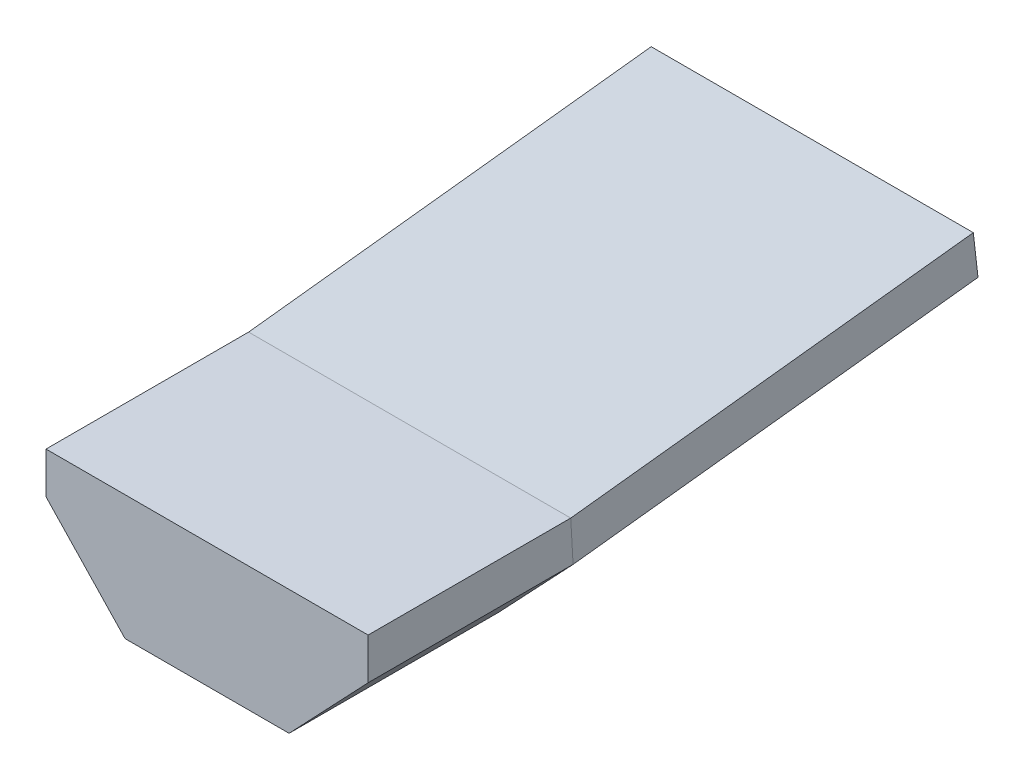
ISO-10303-21;
HEADER;
FILE_DESCRIPTION(('STEP AP214'),'2;1');
FILE_NAME('part.step','',(''),(''),'','','');
FILE_SCHEMA(('AUTOMOTIVE_DESIGN { 1 0 10303 214 1 1 1 1 }'));
ENDSEC;
DATA;
#1=APPLICATION_CONTEXT('core data for automotive mechanical design processes');
#2=APPLICATION_PROTOCOL_DEFINITION('international standard','automotive_design',2000,#1);
#3=PRODUCT_CONTEXT('',#1,'mechanical');
#4=PRODUCT('Part','Part','',(#3));
#5=PRODUCT_RELATED_PRODUCT_CATEGORY('part','',(#4));
#6=PRODUCT_DEFINITION_FORMATION('','',#4);
#7=PRODUCT_DEFINITION_CONTEXT('part definition',#1,'design');
#8=PRODUCT_DEFINITION('design','',#6,#7);
#9=PRODUCT_DEFINITION_SHAPE('','',#8);
#10=(LENGTH_UNIT() NAMED_UNIT(*) SI_UNIT(.MILLI.,.METRE.));
#11=(NAMED_UNIT(*) PLANE_ANGLE_UNIT() SI_UNIT($,.RADIAN.));
#12=(NAMED_UNIT(*) SI_UNIT($,.STERADIAN.) SOLID_ANGLE_UNIT());
#13=UNCERTAINTY_MEASURE_WITH_UNIT(LENGTH_MEASURE(1.E-05),#10,'distance_accuracy_value','');
#14=(GEOMETRIC_REPRESENTATION_CONTEXT(3) GLOBAL_UNCERTAINTY_ASSIGNED_CONTEXT((#13)) GLOBAL_UNIT_ASSIGNED_CONTEXT((#10,
#11,#12)) REPRESENTATION_CONTEXT('',''));
#15=CARTESIAN_POINT('',(0.,0.,0.));
#16=DIRECTION('',(0.,0.,1.));
#17=DIRECTION('',(1.,0.,0.));
#18=AXIS2_PLACEMENT_3D('',#15,#16,#17);
#19=CARTESIAN_POINT('',(0.,2.26406427535814,-29.8714371135318));
#20=DIRECTION('',(0.,0.113203213767907,-0.993571855676587));
#21=DIRECTION('',(-1.,0.,0.));
#22=AXIS2_PLACEMENT_3D('',#19,#20,#21);
#23=PLANE('',#22);
#24=DIRECTION('',(0.688304815664138,0.720758473608971,0.0821200551292038));
#25=VECTOR('',#24,1.);
#26=CARTESIAN_POINT('',(7.95,0.237177689777905,-30.1023716696183));
#27=LINE('',#26,#25);
#28=CARTESIAN_POINT('',(4.048,-3.84880209711135,-30.5679102621457));
#29=VERTEX_POINT('',#28);
#30=CARTESIAN_POINT('',(7.95,0.237177689777905,-30.1023716696183));
#31=VERTEX_POINT('',#30);
#32=EDGE_CURVE('E190',#29,#31,#27,.T.);
#33=ORIENTED_EDGE('',*,*,#32,.F.);
#34=DIRECTION('',(1.,0.,0.));
#35=VECTOR('',#34,1.);
#36=CARTESIAN_POINT('',(4.048,-3.84880209711135,-30.5679102621457));
#37=LINE('',#36,#35);
#38=CARTESIAN_POINT('',(-4.048,-3.84880209711135,-30.5679102621457));
#39=VERTEX_POINT('',#38);
#40=EDGE_CURVE('E147',#39,#29,#37,.T.);
#41=ORIENTED_EDGE('',*,*,#40,.F.);
#42=DIRECTION('',(0.688304815664138,-0.720758473608971,-0.0821200551292038));
#43=VECTOR('',#42,1.);
#44=CARTESIAN_POINT('',(-4.048,-3.84880209711135,-30.5679102621457));
#45=LINE('',#44,#43);
#46=CARTESIAN_POINT('',(-7.95,0.237177689777902,-30.1023716696183));
#47=VERTEX_POINT('',#46);
#48=EDGE_CURVE('E195',#47,#39,#45,.T.);
#49=ORIENTED_EDGE('',*,*,#48,.F.);
#50=DIRECTION('',(0.,-0.993571855676587,-0.113203213767907));
#51=VECTOR('',#50,1.);
#52=CARTESIAN_POINT('',(-7.95,0.237177689777902,-30.1023716696183));
#53=LINE('',#52,#51);
#54=CARTESIAN_POINT('',(-7.95,2.26406427535814,-29.8714371135318));
#55=VERTEX_POINT('',#54);
#56=EDGE_CURVE('E198',#55,#47,#53,.T.);
#57=ORIENTED_EDGE('',*,*,#56,.F.);
#58=DIRECTION('',(-1.,0.,0.));
#59=VECTOR('',#58,1.);
#60=CARTESIAN_POINT('',(-7.95,2.26406427535814,-29.8714371135318));
#61=LINE('',#60,#59);
#62=CARTESIAN_POINT('',(7.95,2.26406427535814,-29.8714371135318));
#63=VERTEX_POINT('',#62);
#64=EDGE_CURVE('E84',#63,#55,#61,.T.);
#65=ORIENTED_EDGE('',*,*,#64,.F.);
#66=DIRECTION('',(0.,0.993571855676587,0.113203213767907));
#67=VECTOR('',#66,1.);
#68=CARTESIAN_POINT('',(7.95,2.26406427535814,-29.8714371135318));
#69=LINE('',#68,#67);
#70=EDGE_CURVE('E92',#31,#63,#69,.T.);
#71=ORIENTED_EDGE('',*,*,#70,.F.);
#72=EDGE_LOOP('',(#33,#41,#49,#57,#65,#71));
#73=FACE_BOUND('',#72,.T.);
#74=ADVANCED_FACE('F43',(#73),#23,.T.);
#75=CARTESIAN_POINT('',(0.,0.,0.));
#76=DIRECTION('',(0.,0.,-1.));
#77=DIRECTION('',(-1.,0.,0.));
#78=AXIS2_PLACEMENT_3D('',#75,#76,#77);
#79=PLANE('',#78);
#80=DIRECTION('',(0.688304815664138,0.725421588273714,0.));
#81=VECTOR('',#80,1.);
#82=CARTESIAN_POINT('',(7.95,-2.04,0.));
#83=LINE('',#82,#81);
#84=CARTESIAN_POINT('',(4.048,-6.15241498392368,0.));
#85=VERTEX_POINT('',#84);
#86=CARTESIAN_POINT('',(7.95,-2.04,0.));
#87=VERTEX_POINT('',#86);
#88=EDGE_CURVE('E164',#85,#87,#83,.T.);
#89=ORIENTED_EDGE('',*,*,#88,.T.);
#90=DIRECTION('',(0.,1.,0.));
#91=VECTOR('',#90,1.);
#92=CARTESIAN_POINT('',(7.95,0.,0.));
#93=LINE('',#92,#91);
#94=CARTESIAN_POINT('',(7.95,0.,0.));
#95=VERTEX_POINT('',#94);
#96=EDGE_CURVE('E180',#87,#95,#93,.T.);
#97=ORIENTED_EDGE('',*,*,#96,.T.);
#98=DIRECTION('',(-1.,0.,0.));
#99=VECTOR('',#98,1.);
#100=CARTESIAN_POINT('',(-7.95,0.,0.));
#101=LINE('',#100,#99);
#102=CARTESIAN_POINT('',(-7.95,0.,0.));
#103=VERTEX_POINT('',#102);
#104=EDGE_CURVE('E100',#95,#103,#101,.T.);
#105=ORIENTED_EDGE('',*,*,#104,.T.);
#106=DIRECTION('',(0.,-1.,0.));
#107=VECTOR('',#106,1.);
#108=CARTESIAN_POINT('',(-7.95,-2.04,0.));
#109=LINE('',#108,#107);
#110=CARTESIAN_POINT('',(-7.95,-2.04,0.));
#111=VERTEX_POINT('',#110);
#112=EDGE_CURVE('E216',#103,#111,#109,.T.);
#113=ORIENTED_EDGE('',*,*,#112,.T.);
#114=DIRECTION('',(0.688304815664138,-0.725421588273713,0.));
#115=VECTOR('',#114,1.);
#116=CARTESIAN_POINT('',(-4.048,-6.15241498392368,0.));
#117=LINE('',#116,#115);
#118=CARTESIAN_POINT('',(-4.048,-6.15241498392368,0.));
#119=VERTEX_POINT('',#118);
#120=EDGE_CURVE('E221',#111,#119,#117,.T.);
#121=ORIENTED_EDGE('',*,*,#120,.T.);
#122=DIRECTION('',(1.,0.,0.));
#123=VECTOR('',#122,1.);
#124=CARTESIAN_POINT('',(4.048,-6.15241498392368,0.));
#125=LINE('',#124,#123);
#126=EDGE_CURVE('E178',#119,#85,#125,.T.);
#127=ORIENTED_EDGE('',*,*,#126,.T.);
#128=EDGE_LOOP('',(#89,#97,#105,#113,#121,#127));
#129=FACE_BOUND('',#128,.T.);
#130=ADVANCED_FACE('F236',(#129),#79,.F.);
#131=CARTESIAN_POINT('',(-7.95,-0.0548237939763967,-9.51881773579292));
#132=DIRECTION('',(0.,-0.993571855676587,-0.113203213767907));
#133=DIRECTION('',(0.,0.113203213767907,-0.993571855676587));
#134=AXIS2_PLACEMENT_3D('',#131,#132,#133);
#135=PLANE('',#134);
#136=DIRECTION('',(1.,0.,0.));
#137=VECTOR('',#136,1.);
#138=CARTESIAN_POINT('',(-7.95,0.,-10.));
#139=LINE('',#138,#137);
#140=CARTESIAN_POINT('',(-7.95,0.,-10.));
#141=VERTEX_POINT('',#140);
#142=CARTESIAN_POINT('',(7.95,0.,-10.));
#143=VERTEX_POINT('',#142);
#144=EDGE_CURVE('E172',#141,#143,#139,.T.);
#145=ORIENTED_EDGE('',*,*,#144,.T.);
#146=DIRECTION('',(0.,0.113203213767907,-0.993571855676587));
#147=VECTOR('',#146,1.);
#148=CARTESIAN_POINT('',(7.95,-0.0548237939763938,-9.51881773579292));
#149=LINE('',#148,#147);
#150=EDGE_CURVE('E46',#143,#63,#149,.T.);
#151=ORIENTED_EDGE('',*,*,#150,.T.);
#152=ORIENTED_EDGE('',*,*,#64,.T.);
#153=DIRECTION('',(0.,0.113203213767907,-0.993571855676587));
#154=VECTOR('',#153,1.);
#155=CARTESIAN_POINT('',(-7.95,-0.0548237939763967,-9.51881773579292));
#156=LINE('',#155,#154);
#157=EDGE_CURVE('E210',#141,#55,#156,.T.);
#158=ORIENTED_EDGE('',*,*,#157,.F.);
#159=EDGE_LOOP('',(#145,#151,#152,#158));
#160=FACE_BOUND('',#159,.T.);
#161=ADVANCED_FACE('F241',(#160),#135,.F.);
#162=CARTESIAN_POINT('',(-7.95,-2.08171037955664,-9.74975229187945));
#163=DIRECTION('',(1.,0.,0.));
#164=DIRECTION('',(0.,1.,0.));
#165=AXIS2_PLACEMENT_3D('',#162,#163,#164);
#166=PLANE('',#165);
#167=DIRECTION('',(0.,0.998391670557349,0.0566927875633777));
#168=VECTOR('',#167,1.);
#169=CARTESIAN_POINT('',(-7.95,-1.46742722395058,-10.0833265564262));
#170=LINE('',#169,#168);
#171=CARTESIAN_POINT('',(-7.95,-2.04,-10.1158395948603));
#172=VERTEX_POINT('',#171);
#173=EDGE_CURVE('E11',#172,#141,#170,.T.);
#174=ORIENTED_EDGE('',*,*,#173,.T.);
#175=ORIENTED_EDGE('',*,*,#157,.T.);
#176=ORIENTED_EDGE('',*,*,#56,.T.);
#177=DIRECTION('',(0.,0.113203213767907,-0.993571855676587));
#178=VECTOR('',#177,1.);
#179=CARTESIAN_POINT('',(-7.95,-2.08171037955664,-9.74975229187945));
#180=LINE('',#179,#178);
#181=EDGE_CURVE('E207',#172,#47,#180,.T.);
#182=ORIENTED_EDGE('',*,*,#181,.F.);
#183=EDGE_LOOP('',(#174,#175,#176,#182));
#184=FACE_BOUND('',#183,.T.);
#185=ADVANCED_FACE('F242',(#184),#166,.F.);
#186=CARTESIAN_POINT('',(-4.048,-6.16769016644589,-10.2152908844069));
#187=DIRECTION('',(0.725421588273713,0.683880292970549,0.0779183171851072));
#188=DIRECTION('',(-0.685965803005265,0.727633779526034,0.));
#189=AXIS2_PLACEMENT_3D('',#186,#187,#188);
#190=PLANE('',#189);
#191=DIRECTION('',(-0.68772159456062,0.724806917026905,0.0411575194217455));
#192=VECTOR('',#191,1.);
#193=CARTESIAN_POINT('',(-4.34093773808377,-5.84368060579647,-10.3318282322885));
#194=LINE('',#193,#192);
#195=CARTESIAN_POINT('',(-4.048,-6.15241498392368,-10.34935944076));
#196=VERTEX_POINT('',#195);
#197=EDGE_CURVE('E53',#196,#172,#194,.T.);
#198=ORIENTED_EDGE('',*,*,#197,.T.);
#199=ORIENTED_EDGE('',*,*,#181,.T.);
#200=ORIENTED_EDGE('',*,*,#48,.T.);
#201=DIRECTION('',(0.,0.113203213767907,-0.993571855676587));
#202=VECTOR('',#201,1.);
#203=CARTESIAN_POINT('',(-4.048,-6.16769016644589,-10.2152908844069));
#204=LINE('',#203,#202);
#205=EDGE_CURVE('E151',#196,#39,#204,.T.);
#206=ORIENTED_EDGE('',*,*,#205,.F.);
#207=EDGE_LOOP('',(#198,#199,#200,#206));
#208=FACE_BOUND('',#207,.T.);
#209=ADVANCED_FACE('F251',(#208),#190,.F.);
#210=CARTESIAN_POINT('',(4.048,-6.16769016644589,-10.2152908844069));
#211=DIRECTION('',(0.,0.993571855676587,0.113203213767907));
#212=DIRECTION('',(0.,-0.113203213767907,0.993571855676587));
#213=AXIS2_PLACEMENT_3D('',#210,#211,#212);
#214=PLANE('',#213);
#215=DIRECTION('',(-1.,0.,0.));
#216=VECTOR('',#215,1.);
#217=CARTESIAN_POINT('',(4.048,-6.15241498392368,-10.34935944076));
#218=LINE('',#217,#216);
#219=CARTESIAN_POINT('',(4.048,-6.15241498392368,-10.34935944076));
#220=VERTEX_POINT('',#219);
#221=EDGE_CURVE('E130',#220,#196,#218,.T.);
#222=ORIENTED_EDGE('',*,*,#221,.T.);
#223=ORIENTED_EDGE('',*,*,#205,.T.);
#224=ORIENTED_EDGE('',*,*,#40,.T.);
#225=DIRECTION('',(0.,0.113203213767907,-0.993571855676587));
#226=VECTOR('',#225,1.);
#227=CARTESIAN_POINT('',(4.048,-6.16769016644589,-10.2152908844069));
#228=LINE('',#227,#226);
#229=EDGE_CURVE('E143',#220,#29,#228,.T.);
#230=ORIENTED_EDGE('',*,*,#229,.F.);
#231=EDGE_LOOP('',(#222,#223,#224,#230));
#232=FACE_BOUND('',#231,.T.);
#233=ADVANCED_FACE('F145',(#232),#214,.F.);
#234=CARTESIAN_POINT('',(7.95,-2.08171037955663,-9.74975229187945));
#235=DIRECTION('',(-0.725421588273714,0.683880292970549,0.0779183171851072));
#236=DIRECTION('',(-0.685965803005265,-0.727633779526035,0.));
#237=AXIS2_PLACEMENT_3D('',#234,#235,#236);
#238=PLANE('',#237);
#239=DIRECTION('',(-0.68772159456062,-0.724806917026905,-0.0411575194217455));
#240=VECTOR('',#239,1.);
#241=CARTESIAN_POINT('',(8.23632797872165,-1.73823181188839,-10.0987039553247));
#242=LINE('',#241,#240);
#243=CARTESIAN_POINT('',(7.95,-2.04,-10.1158395948603));
#244=VERTEX_POINT('',#243);
#245=EDGE_CURVE('E140',#244,#220,#242,.T.);
#246=ORIENTED_EDGE('',*,*,#245,.T.);
#247=ORIENTED_EDGE('',*,*,#229,.T.);
#248=ORIENTED_EDGE('',*,*,#32,.T.);
#249=DIRECTION('',(0.,0.113203213767907,-0.993571855676587));
#250=VECTOR('',#249,1.);
#251=CARTESIAN_POINT('',(7.95,-2.08171037955663,-9.74975229187945));
#252=LINE('',#251,#250);
#253=EDGE_CURVE('E152',#244,#31,#252,.T.);
#254=ORIENTED_EDGE('',*,*,#253,.F.);
#255=EDGE_LOOP('',(#246,#247,#248,#254));
#256=FACE_BOUND('',#255,.T.);
#257=ADVANCED_FACE('F155',(#256),#238,.F.);
#258=CARTESIAN_POINT('',(7.95,-0.0548237939763938,-9.51881773579292));
#259=DIRECTION('',(-1.,0.,0.));
#260=DIRECTION('',(0.,-1.,0.));
#261=AXIS2_PLACEMENT_3D('',#258,#259,#260);
#262=PLANE('',#261);
#263=DIRECTION('',(0.,-0.998391670557349,-0.0566927875633777));
#264=VECTOR('',#263,1.);
#265=CARTESIAN_POINT('',(7.95,0.566016068839538,-9.96785927838294));
#266=LINE('',#265,#264);
#267=EDGE_CURVE('E160',#143,#244,#266,.T.);
#268=ORIENTED_EDGE('',*,*,#267,.T.);
#269=ORIENTED_EDGE('',*,*,#253,.T.);
#270=ORIENTED_EDGE('',*,*,#70,.T.);
#271=ORIENTED_EDGE('',*,*,#150,.F.);
#272=EDGE_LOOP('',(#268,#269,#270,#271));
#273=FACE_BOUND('',#272,.T.);
#274=ADVANCED_FACE('F254',(#273),#262,.F.);
#275=CARTESIAN_POINT('',(7.95,0.,0.));
#276=DIRECTION('',(-1.,0.,0.));
#277=DIRECTION('',(0.,-1.,0.));
#278=AXIS2_PLACEMENT_3D('',#275,#276,#277);
#279=PLANE('',#278);
#280=DIRECTION('',(0.,0.,-1.));
#281=VECTOR('',#280,1.);
#282=CARTESIAN_POINT('',(7.95,0.,0.));
#283=LINE('',#282,#281);
#284=EDGE_CURVE('E184',#95,#143,#283,.T.);
#285=ORIENTED_EDGE('',*,*,#284,.F.);
#286=ORIENTED_EDGE('',*,*,#96,.F.);
#287=DIRECTION('',(0.,0.,-1.));
#288=VECTOR('',#287,1.);
#289=CARTESIAN_POINT('',(7.95,-2.04,0.));
#290=LINE('',#289,#288);
#291=EDGE_CURVE('E167',#87,#244,#290,.T.);
#292=ORIENTED_EDGE('',*,*,#291,.T.);
#293=ORIENTED_EDGE('',*,*,#267,.F.);
#294=EDGE_LOOP('',(#285,#286,#292,#293));
#295=FACE_BOUND('',#294,.T.);
#296=ADVANCED_FACE('F239',(#295),#279,.F.);
#297=CARTESIAN_POINT('',(7.95,-2.04,0.));
#298=DIRECTION('',(-0.725421588273714,0.688304815664138,0.));
#299=DIRECTION('',(-0.688304815664138,-0.725421588273714,0.));
#300=AXIS2_PLACEMENT_3D('',#297,#298,#299);
#301=PLANE('',#300);
#302=ORIENTED_EDGE('',*,*,#291,.F.);
#303=ORIENTED_EDGE('',*,*,#88,.F.);
#304=DIRECTION('',(0.,0.,-1.));
#305=VECTOR('',#304,1.);
#306=CARTESIAN_POINT('',(4.048,-6.15241498392368,0.));
#307=LINE('',#306,#305);
#308=EDGE_CURVE('E134',#85,#220,#307,.T.);
#309=ORIENTED_EDGE('',*,*,#308,.T.);
#310=ORIENTED_EDGE('',*,*,#245,.F.);
#311=EDGE_LOOP('',(#302,#303,#309,#310));
#312=FACE_BOUND('',#311,.T.);
#313=ADVANCED_FACE('F162',(#312),#301,.F.);
#314=CARTESIAN_POINT('',(4.048,-6.15241498392368,0.));
#315=DIRECTION('',(0.,1.,0.));
#316=DIRECTION('',(-1.,0.,0.));
#317=AXIS2_PLACEMENT_3D('',#314,#315,#316);
#318=PLANE('',#317);
#319=ORIENTED_EDGE('',*,*,#308,.F.);
#320=ORIENTED_EDGE('',*,*,#126,.F.);
#321=DIRECTION('',(0.,0.,-1.));
#322=VECTOR('',#321,1.);
#323=CARTESIAN_POINT('',(-4.048,-6.15241498392368,0.));
#324=LINE('',#323,#322);
#325=EDGE_CURVE('E136',#119,#196,#324,.T.);
#326=ORIENTED_EDGE('',*,*,#325,.T.);
#327=ORIENTED_EDGE('',*,*,#221,.F.);
#328=EDGE_LOOP('',(#319,#320,#326,#327));
#329=FACE_BOUND('',#328,.T.);
#330=ADVANCED_FACE('F132',(#329),#318,.F.);
#331=CARTESIAN_POINT('',(-4.048,-6.15241498392368,0.));
#332=DIRECTION('',(0.725421588273713,0.688304815664138,0.));
#333=DIRECTION('',(-0.688304815664138,0.725421588273713,0.));
#334=AXIS2_PLACEMENT_3D('',#331,#332,#333);
#335=PLANE('',#334);
#336=ORIENTED_EDGE('',*,*,#325,.F.);
#337=ORIENTED_EDGE('',*,*,#120,.F.);
#338=DIRECTION('',(0.,0.,-1.));
#339=VECTOR('',#338,1.);
#340=CARTESIAN_POINT('',(-7.95,-2.04,0.));
#341=LINE('',#340,#339);
#342=EDGE_CURVE('E174',#111,#172,#341,.T.);
#343=ORIENTED_EDGE('',*,*,#342,.T.);
#344=ORIENTED_EDGE('',*,*,#197,.F.);
#345=EDGE_LOOP('',(#336,#337,#343,#344));
#346=FACE_BOUND('',#345,.T.);
#347=ADVANCED_FACE('F246',(#346),#335,.F.);
#348=CARTESIAN_POINT('',(-7.95,-2.04,0.));
#349=DIRECTION('',(1.,0.,0.));
#350=DIRECTION('',(0.,1.,0.));
#351=AXIS2_PLACEMENT_3D('',#348,#349,#350);
#352=PLANE('',#351);
#353=ORIENTED_EDGE('',*,*,#342,.F.);
#354=ORIENTED_EDGE('',*,*,#112,.F.);
#355=DIRECTION('',(0.,0.,-1.));
#356=VECTOR('',#355,1.);
#357=CARTESIAN_POINT('',(-7.95,0.,0.));
#358=LINE('',#357,#356);
#359=EDGE_CURVE('E225',#103,#141,#358,.T.);
#360=ORIENTED_EDGE('',*,*,#359,.T.);
#361=ORIENTED_EDGE('',*,*,#173,.F.);
#362=EDGE_LOOP('',(#353,#354,#360,#361));
#363=FACE_BOUND('',#362,.T.);
#364=ADVANCED_FACE('F244',(#363),#352,.F.);
#365=CARTESIAN_POINT('',(-7.95,0.,0.));
#366=DIRECTION('',(0.,-1.,0.));
#367=DIRECTION('',(1.,0.,0.));
#368=AXIS2_PLACEMENT_3D('',#365,#366,#367);
#369=PLANE('',#368);
#370=ORIENTED_EDGE('',*,*,#359,.F.);
#371=ORIENTED_EDGE('',*,*,#104,.F.);
#372=ORIENTED_EDGE('',*,*,#284,.T.);
#373=ORIENTED_EDGE('',*,*,#144,.F.);
#374=EDGE_LOOP('',(#370,#371,#372,#373));
#375=FACE_BOUND('',#374,.T.);
#376=ADVANCED_FACE('F240',(#375),#369,.F.);
#377=CLOSED_SHELL('',(#74,#130,#161,#185,#209,#233,#257,#274,#296,#313,#330,#347,#364,#376));
#378=MANIFOLD_SOLID_BREP('B2',#377);
#379=ADVANCED_BREP_SHAPE_REPRESENTATION('',(#18,#378),#14);
#380=SHAPE_DEFINITION_REPRESENTATION(#9,#379);
ENDSEC;
END-ISO-10303-21;
